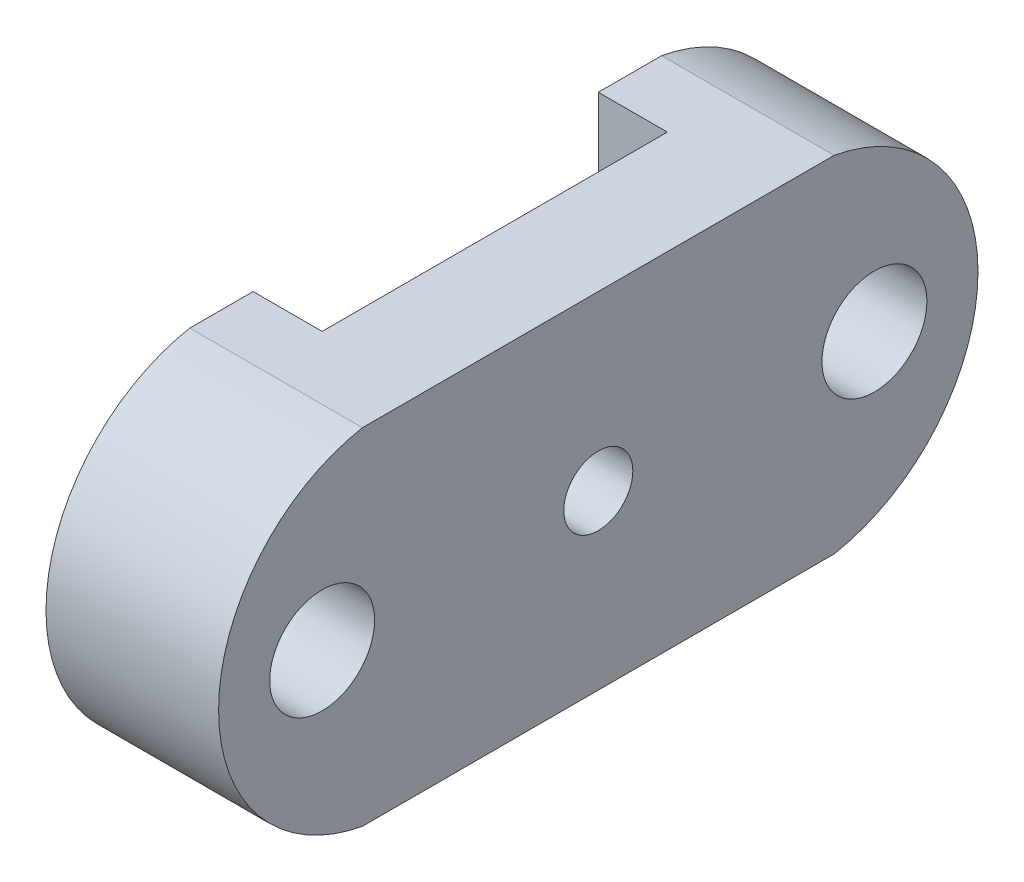
ISO-10303-21;
HEADER;
FILE_DESCRIPTION(('STEP AP214'),'2;1');
FILE_NAME('part.step','',(''),(''),'','','');
FILE_SCHEMA(('AUTOMOTIVE_DESIGN { 1 0 10303 214 1 1 1 1 }'));
ENDSEC;
DATA;
#1=APPLICATION_CONTEXT('core data for automotive mechanical design processes');
#2=APPLICATION_PROTOCOL_DEFINITION('international standard','automotive_design',2000,#1);
#3=PRODUCT_CONTEXT('',#1,'mechanical');
#4=PRODUCT('Part','Part','',(#3));
#5=PRODUCT_RELATED_PRODUCT_CATEGORY('part','',(#4));
#6=PRODUCT_DEFINITION_FORMATION('','',#4);
#7=PRODUCT_DEFINITION_CONTEXT('part definition',#1,'design');
#8=PRODUCT_DEFINITION('design','',#6,#7);
#9=PRODUCT_DEFINITION_SHAPE('','',#8);
#10=(LENGTH_UNIT() NAMED_UNIT(*) SI_UNIT(.MILLI.,.METRE.));
#11=(NAMED_UNIT(*) PLANE_ANGLE_UNIT() SI_UNIT($,.RADIAN.));
#12=(NAMED_UNIT(*) SI_UNIT($,.STERADIAN.) SOLID_ANGLE_UNIT());
#13=UNCERTAINTY_MEASURE_WITH_UNIT(LENGTH_MEASURE(1.E-05),#10,'distance_accuracy_value','');
#14=(GEOMETRIC_REPRESENTATION_CONTEXT(3) GLOBAL_UNCERTAINTY_ASSIGNED_CONTEXT((#13)) GLOBAL_UNIT_ASSIGNED_CONTEXT((#10,
#11,#12)) REPRESENTATION_CONTEXT('',''));
#15=CARTESIAN_POINT('',(0.,0.,0.));
#16=DIRECTION('',(0.,0.,1.));
#17=DIRECTION('',(1.,0.,0.));
#18=AXIS2_PLACEMENT_3D('',#15,#16,#17);
#19=CARTESIAN_POINT('',(0.,0.,0.));
#20=DIRECTION('',(-1.,0.,0.));
#21=DIRECTION('',(0.,0.,1.));
#22=AXIS2_PLACEMENT_3D('',#19,#20,#21);
#23=PLANE('',#22);
#24=CARTESIAN_POINT('',(0.,-0.00691388179685504,40.));
#25=DIRECTION('',(1.,0.,0.));
#26=DIRECTION('',(0.,0.,-1.));
#27=AXIS2_PLACEMENT_3D('',#24,#25,#26);
#28=CIRCLE('',#27,7.6);
#29=CARTESIAN_POINT('',(0.,-0.00691388179685504,32.4));
#30=VERTEX_POINT('',#29);
#31=EDGE_CURVE('E272',#30,#30,#28,.T.);
#32=ORIENTED_EDGE('',*,*,#31,.T.);
#33=EDGE_LOOP('',(#32));
#34=FACE_BOUND('',#33,.T.);
#35=DIRECTION('',(0.,0.,1.));
#36=VECTOR('',#35,1.);
#37=CARTESIAN_POINT('',(0.,-25.,-55.));
#38=LINE('',#37,#36);
#39=CARTESIAN_POINT('',(0.,-25.,25.));
#40=VERTEX_POINT('',#39);
#41=CARTESIAN_POINT('',(0.,-25.,34.1666666666667));
#42=VERTEX_POINT('',#41);
#43=EDGE_CURVE('E276',#40,#42,#38,.T.);
#44=ORIENTED_EDGE('',*,*,#43,.T.);
#45=CARTESIAN_POINT('',(0.,0.,29.5833333333333));
#46=DIRECTION('',(1.,0.,0.));
#47=DIRECTION('',(0.,0.,1.));
#48=AXIS2_PLACEMENT_3D('',#45,#46,#47);
#49=CIRCLE('',#48,25.4166666666667);
#50=CARTESIAN_POINT('',(0.,25.,34.1666666666667));
#51=VERTEX_POINT('',#50);
#52=EDGE_CURVE('E159',#51,#42,#49,.T.);
#53=ORIENTED_EDGE('',*,*,#52,.F.);
#54=DIRECTION('',(0.,0.,1.));
#55=VECTOR('',#54,1.);
#56=CARTESIAN_POINT('',(0.,25.,-55.));
#57=LINE('',#56,#55);
#58=CARTESIAN_POINT('',(0.,25.,25.));
#59=VERTEX_POINT('',#58);
#60=EDGE_CURVE('E293',#59,#51,#57,.T.);
#61=ORIENTED_EDGE('',*,*,#60,.F.);
#62=DIRECTION('',(0.,-1.,0.));
#63=VECTOR('',#62,1.);
#64=CARTESIAN_POINT('',(0.,25.,25.));
#65=LINE('',#64,#63);
#66=EDGE_CURVE('E254',#59,#40,#65,.T.);
#67=ORIENTED_EDGE('',*,*,#66,.T.);
#68=EDGE_LOOP('',(#44,#53,#61,#67));
#69=FACE_BOUND('',#68,.T.);
#70=ADVANCED_FACE('F38',(#34,#69),#23,.T.);
#71=CARTESIAN_POINT('',(25.,0.,0.));
#72=DIRECTION('',(-1.,0.,0.));
#73=DIRECTION('',(0.,0.,1.));
#74=AXIS2_PLACEMENT_3D('',#71,#72,#73);
#75=PLANE('',#74);
#76=CARTESIAN_POINT('',(25.,0.,0.));
#77=DIRECTION('',(1.,0.,0.));
#78=DIRECTION('',(0.,0.,-1.));
#79=AXIS2_PLACEMENT_3D('',#76,#77,#78);
#80=CIRCLE('',#79,5.);
#81=CARTESIAN_POINT('',(25.,0.,-5.));
#82=VERTEX_POINT('',#81);
#83=EDGE_CURVE('E258',#82,#82,#80,.T.);
#84=ORIENTED_EDGE('',*,*,#83,.F.);
#85=EDGE_LOOP('',(#84));
#86=FACE_BOUND('',#85,.T.);
#87=CARTESIAN_POINT('',(25.,-0.00691388179685504,40.));
#88=DIRECTION('',(1.,0.,0.));
#89=DIRECTION('',(0.,0.,-1.));
#90=AXIS2_PLACEMENT_3D('',#87,#88,#89);
#91=CIRCLE('',#90,7.6);
#92=CARTESIAN_POINT('',(25.,-0.00691388179685504,32.4));
#93=VERTEX_POINT('',#92);
#94=EDGE_CURVE('E277',#93,#93,#91,.T.);
#95=ORIENTED_EDGE('',*,*,#94,.F.);
#96=EDGE_LOOP('',(#95));
#97=FACE_BOUND('',#96,.T.);
#98=CARTESIAN_POINT('',(25.,-0.00691388179685504,-40.));
#99=DIRECTION('',(1.,0.,0.));
#100=DIRECTION('',(0.,0.,-1.));
#101=AXIS2_PLACEMENT_3D('',#98,#99,#100);
#102=CIRCLE('',#101,7.6);
#103=CARTESIAN_POINT('',(25.,-0.00691388179685504,-47.6));
#104=VERTEX_POINT('',#103);
#105=EDGE_CURVE('E271',#104,#104,#102,.T.);
#106=ORIENTED_EDGE('',*,*,#105,.F.);
#107=EDGE_LOOP('',(#106));
#108=FACE_BOUND('',#107,.T.);
#109=DIRECTION('',(0.,0.,1.));
#110=VECTOR('',#109,1.);
#111=CARTESIAN_POINT('',(25.,-25.,-55.));
#112=LINE('',#111,#110);
#113=CARTESIAN_POINT('',(25.,-25.,-34.1666666666666));
#114=VERTEX_POINT('',#113);
#115=CARTESIAN_POINT('',(25.,-25.,34.1666666666667));
#116=VERTEX_POINT('',#115);
#117=EDGE_CURVE('E48',#114,#116,#112,.T.);
#118=ORIENTED_EDGE('',*,*,#117,.F.);
#119=CARTESIAN_POINT('',(25.,0.,-29.5833333333333));
#120=DIRECTION('',(-1.,0.,0.));
#121=DIRECTION('',(0.,0.,1.));
#122=AXIS2_PLACEMENT_3D('',#119,#120,#121);
#123=CIRCLE('',#122,25.4166666666667);
#124=CARTESIAN_POINT('',(25.,25.,-34.1666666666667));
#125=VERTEX_POINT('',#124);
#126=EDGE_CURVE('E160',#125,#114,#123,.T.);
#127=ORIENTED_EDGE('',*,*,#126,.F.);
#128=DIRECTION('',(0.,0.,1.));
#129=VECTOR('',#128,1.);
#130=CARTESIAN_POINT('',(25.,25.,-55.));
#131=LINE('',#130,#129);
#132=CARTESIAN_POINT('',(25.,25.,34.1666666666667));
#133=VERTEX_POINT('',#132);
#134=EDGE_CURVE('E11',#125,#133,#131,.T.);
#135=ORIENTED_EDGE('',*,*,#134,.T.);
#136=CARTESIAN_POINT('',(25.,0.,29.5833333333333));
#137=DIRECTION('',(-1.,0.,0.));
#138=DIRECTION('',(0.,0.,1.));
#139=AXIS2_PLACEMENT_3D('',#136,#137,#138);
#140=CIRCLE('',#139,25.4166666666667);
#141=EDGE_CURVE('E167',#116,#133,#140,.T.);
#142=ORIENTED_EDGE('',*,*,#141,.F.);
#143=EDGE_LOOP('',(#118,#127,#135,#142));
#144=FACE_BOUND('',#143,.T.);
#145=ADVANCED_FACE('F338',(#86,#97,#108,#144),#75,.F.);
#146=CARTESIAN_POINT('',(0.,-0.00691388179685504,-40.));
#147=DIRECTION('',(1.,0.,0.));
#148=DIRECTION('',(0.,0.,-1.));
#149=AXIS2_PLACEMENT_3D('',#146,#147,#148);
#150=CIRCLE('',#149,7.6);
#151=CARTESIAN_POINT('',(0.,-0.00691388179685504,-47.6));
#152=VERTEX_POINT('',#151);
#153=EDGE_CURVE('E281',#152,#152,#150,.T.);
#154=ORIENTED_EDGE('',*,*,#153,.T.);
#155=EDGE_LOOP('',(#154));
#156=FACE_BOUND('',#155,.T.);
#157=CARTESIAN_POINT('',(0.,0.,-29.5833333333333));
#158=DIRECTION('',(1.,0.,0.));
#159=DIRECTION('',(0.,0.,-1.));
#160=AXIS2_PLACEMENT_3D('',#157,#158,#159);
#161=CIRCLE('',#160,25.4166666666667);
#162=CARTESIAN_POINT('',(0.,-25.,-34.1666666666666));
#163=VERTEX_POINT('',#162);
#164=CARTESIAN_POINT('',(0.,25.,-34.1666666666667));
#165=VERTEX_POINT('',#164);
#166=EDGE_CURVE('E164',#163,#165,#161,.T.);
#167=ORIENTED_EDGE('',*,*,#166,.F.);
#168=CARTESIAN_POINT('',(0.,-25.,-25.));
#169=VERTEX_POINT('',#168);
#170=EDGE_CURVE('E291',#163,#169,#38,.T.);
#171=ORIENTED_EDGE('',*,*,#170,.T.);
#172=DIRECTION('',(0.,-1.,0.));
#173=VECTOR('',#172,1.);
#174=CARTESIAN_POINT('',(0.,25.,-25.));
#175=LINE('',#174,#173);
#176=CARTESIAN_POINT('',(0.,25.,-25.));
#177=VERTEX_POINT('',#176);
#178=EDGE_CURVE('E243',#177,#169,#175,.T.);
#179=ORIENTED_EDGE('',*,*,#178,.F.);
#180=EDGE_CURVE('E289',#165,#177,#57,.T.);
#181=ORIENTED_EDGE('',*,*,#180,.F.);
#182=EDGE_LOOP('',(#167,#171,#179,#181));
#183=FACE_BOUND('',#182,.T.);
#184=ADVANCED_FACE('F341',(#156,#183),#23,.T.);
#185=CARTESIAN_POINT('',(25.,-25.,-55.));
#186=DIRECTION('',(0.,-1.,0.));
#187=DIRECTION('',(0.,0.,-1.));
#188=AXIS2_PLACEMENT_3D('',#185,#186,#187);
#189=PLANE('',#188);
#190=CARTESIAN_POINT('',(16.9847717652036,-25.,-19.));
#191=DIRECTION('',(0.,-1.,0.));
#192=DIRECTION('',(0.,0.,-1.));
#193=AXIS2_PLACEMENT_3D('',#190,#191,#192);
#194=CIRCLE('',#193,1.25);
#195=CARTESIAN_POINT('',(16.9847717652036,-25.,-20.25));
#196=VERTEX_POINT('',#195);
#197=EDGE_CURVE('E146',#196,#196,#194,.T.);
#198=ORIENTED_EDGE('',*,*,#197,.F.);
#199=EDGE_LOOP('',(#198));
#200=FACE_BOUND('',#199,.T.);
#201=CARTESIAN_POINT('',(16.9847717652036,-25.,19.));
#202=DIRECTION('',(0.,-1.,0.));
#203=DIRECTION('',(0.,0.,-1.));
#204=AXIS2_PLACEMENT_3D('',#201,#202,#203);
#205=CIRCLE('',#204,1.25);
#206=CARTESIAN_POINT('',(16.9847717652036,-25.,17.75));
#207=VERTEX_POINT('',#206);
#208=EDGE_CURVE('E145',#207,#207,#205,.T.);
#209=ORIENTED_EDGE('',*,*,#208,.F.);
#210=EDGE_LOOP('',(#209));
#211=FACE_BOUND('',#210,.T.);
#212=DIRECTION('',(0.,0.,1.));
#213=VECTOR('',#212,1.);
#214=CARTESIAN_POINT('',(10.,-25.,-25.));
#215=LINE('',#214,#213);
#216=CARTESIAN_POINT('',(10.,-25.,-25.));
#217=VERTEX_POINT('',#216);
#218=CARTESIAN_POINT('',(10.,-25.,25.));
#219=VERTEX_POINT('',#218);
#220=EDGE_CURVE('E248',#217,#219,#215,.T.);
#221=ORIENTED_EDGE('',*,*,#220,.F.);
#222=DIRECTION('',(1.,0.,0.));
#223=VECTOR('',#222,1.);
#224=CARTESIAN_POINT('',(0.,-25.,-25.));
#225=LINE('',#224,#223);
#226=EDGE_CURVE('E244',#169,#217,#225,.T.);
#227=ORIENTED_EDGE('',*,*,#226,.F.);
#228=ORIENTED_EDGE('',*,*,#170,.F.);
#229=DIRECTION('',(-1.,0.,0.));
#230=VECTOR('',#229,1.);
#231=CARTESIAN_POINT('',(114.30757772586,-25.,-34.1666666666666));
#232=LINE('',#231,#230);
#233=EDGE_CURVE('E176',#114,#163,#232,.T.);
#234=ORIENTED_EDGE('',*,*,#233,.F.);
#235=ORIENTED_EDGE('',*,*,#117,.T.);
#236=DIRECTION('',(-1.,0.,0.));
#237=VECTOR('',#236,1.);
#238=CARTESIAN_POINT('',(114.30757772586,-25.,34.1666666666667));
#239=LINE('',#238,#237);
#240=EDGE_CURVE('E184',#42,#116,#239,.F.);
#241=ORIENTED_EDGE('',*,*,#240,.F.);
#242=ORIENTED_EDGE('',*,*,#43,.F.);
#243=DIRECTION('',(-1.,0.,0.));
#244=VECTOR('',#243,1.);
#245=CARTESIAN_POINT('',(10.,-25.,25.));
#246=LINE('',#245,#244);
#247=EDGE_CURVE('E235',#219,#40,#246,.T.);
#248=ORIENTED_EDGE('',*,*,#247,.F.);
#249=EDGE_LOOP('',(#221,#227,#228,#234,#235,#241,#242,#248));
#250=FACE_BOUND('',#249,.T.);
#251=ADVANCED_FACE('F40',(#200,#211,#250),#189,.T.);
#252=CARTESIAN_POINT('',(25.,25.,-55.));
#253=DIRECTION('',(0.,-1.,0.));
#254=DIRECTION('',(0.,0.,-1.));
#255=AXIS2_PLACEMENT_3D('',#252,#253,#254);
#256=PLANE('',#255);
#257=DIRECTION('',(-1.,0.,0.));
#258=VECTOR('',#257,1.);
#259=CARTESIAN_POINT('',(114.30757772586,25.,34.1666666666667));
#260=LINE('',#259,#258);
#261=EDGE_CURVE('E180',#51,#133,#260,.F.);
#262=ORIENTED_EDGE('',*,*,#261,.T.);
#263=ORIENTED_EDGE('',*,*,#134,.F.);
#264=DIRECTION('',(-1.,0.,0.));
#265=VECTOR('',#264,1.);
#266=CARTESIAN_POINT('',(114.30757772586,25.,-34.1666666666667));
#267=LINE('',#266,#265);
#268=EDGE_CURVE('E163',#125,#165,#267,.T.);
#269=ORIENTED_EDGE('',*,*,#268,.T.);
#270=ORIENTED_EDGE('',*,*,#180,.T.);
#271=DIRECTION('',(1.,0.,0.));
#272=VECTOR('',#271,1.);
#273=CARTESIAN_POINT('',(0.,25.,-25.));
#274=LINE('',#273,#272);
#275=CARTESIAN_POINT('',(10.,25.,-25.));
#276=VERTEX_POINT('',#275);
#277=EDGE_CURVE('E230',#177,#276,#274,.T.);
#278=ORIENTED_EDGE('',*,*,#277,.T.);
#279=DIRECTION('',(0.,0.,1.));
#280=VECTOR('',#279,1.);
#281=CARTESIAN_POINT('',(10.,25.,-25.));
#282=LINE('',#281,#280);
#283=CARTESIAN_POINT('',(10.,25.,25.));
#284=VERTEX_POINT('',#283);
#285=EDGE_CURVE('E234',#276,#284,#282,.T.);
#286=ORIENTED_EDGE('',*,*,#285,.T.);
#287=DIRECTION('',(-1.,0.,0.));
#288=VECTOR('',#287,1.);
#289=CARTESIAN_POINT('',(10.,25.,25.));
#290=LINE('',#289,#288);
#291=EDGE_CURVE('E239',#284,#59,#290,.T.);
#292=ORIENTED_EDGE('',*,*,#291,.T.);
#293=ORIENTED_EDGE('',*,*,#60,.T.);
#294=EDGE_LOOP('',(#262,#263,#269,#270,#278,#286,#292,#293));
#295=FACE_BOUND('',#294,.T.);
#296=ADVANCED_FACE('F301',(#295),#256,.F.);
#297=CARTESIAN_POINT('',(0.,-0.00691388179685504,-40.));
#298=DIRECTION('',(1.,0.,0.));
#299=DIRECTION('',(0.,0.,-1.));
#300=AXIS2_PLACEMENT_3D('',#297,#298,#299);
#301=CYLINDRICAL_SURFACE('',#300,7.6);
#302=ORIENTED_EDGE('',*,*,#153,.F.);
#303=EDGE_LOOP('',(#302));
#304=FACE_BOUND('',#303,.T.);
#305=ORIENTED_EDGE('',*,*,#105,.T.);
#306=EDGE_LOOP('',(#305));
#307=FACE_BOUND('',#306,.T.);
#308=ADVANCED_FACE('F381',(#304,#307),#301,.F.);
#309=CARTESIAN_POINT('',(0.,-0.00691388179685504,40.));
#310=DIRECTION('',(1.,0.,0.));
#311=DIRECTION('',(0.,0.,-1.));
#312=AXIS2_PLACEMENT_3D('',#309,#310,#311);
#313=CYLINDRICAL_SURFACE('',#312,7.6);
#314=ORIENTED_EDGE('',*,*,#31,.F.);
#315=EDGE_LOOP('',(#314));
#316=FACE_BOUND('',#315,.T.);
#317=ORIENTED_EDGE('',*,*,#94,.T.);
#318=EDGE_LOOP('',(#317));
#319=FACE_BOUND('',#318,.T.);
#320=ADVANCED_FACE('F378',(#316,#319),#313,.F.);
#321=CARTESIAN_POINT('',(25.,0.,0.));
#322=DIRECTION('',(1.,0.,0.));
#323=DIRECTION('',(0.,0.,-1.));
#324=AXIS2_PLACEMENT_3D('',#321,#322,#323);
#325=CYLINDRICAL_SURFACE('',#324,5.);
#326=CARTESIAN_POINT('',(16.8,0.,0.));
#327=DIRECTION('',(1.,0.,0.));
#328=DIRECTION('',(0.,0.,-1.));
#329=AXIS2_PLACEMENT_3D('',#326,#327,#328);
#330=CIRCLE('',#329,5.);
#331=CARTESIAN_POINT('',(16.8,0.,-5.));
#332=VERTEX_POINT('',#331);
#333=EDGE_CURVE('E42',#332,#332,#330,.F.);
#334=ORIENTED_EDGE('',*,*,#333,.T.);
#335=EDGE_LOOP('',(#334));
#336=FACE_BOUND('',#335,.T.);
#337=ORIENTED_EDGE('',*,*,#83,.T.);
#338=EDGE_LOOP('',(#337));
#339=FACE_BOUND('',#338,.T.);
#340=ADVANCED_FACE('F317',(#336,#339),#325,.F.);
#341=CARTESIAN_POINT('',(10.,25.,-25.));
#342=DIRECTION('',(1.,0.,0.));
#343=DIRECTION('',(0.,0.,-1.));
#344=AXIS2_PLACEMENT_3D('',#341,#342,#343);
#345=PLANE('',#344);
#346=DIRECTION('',(0.,0.,1.));
#347=VECTOR('',#346,1.);
#348=CARTESIAN_POINT('',(10.,-7.5,6.5));
#349=LINE('',#348,#347);
#350=CARTESIAN_POINT('',(10.,-7.5,-6.5));
#351=VERTEX_POINT('',#350);
#352=CARTESIAN_POINT('',(10.,-7.5,6.5));
#353=VERTEX_POINT('',#352);
#354=EDGE_CURVE('E208',#351,#353,#349,.T.);
#355=ORIENTED_EDGE('',*,*,#354,.F.);
#356=DIRECTION('',(0.,-1.,0.));
#357=VECTOR('',#356,1.);
#358=CARTESIAN_POINT('',(10.,7.5,-6.5));
#359=LINE('',#358,#357);
#360=CARTESIAN_POINT('',(10.,7.5,-6.5));
#361=VERTEX_POINT('',#360);
#362=EDGE_CURVE('E63',#361,#351,#359,.T.);
#363=ORIENTED_EDGE('',*,*,#362,.F.);
#364=DIRECTION('',(0.,0.,-1.));
#365=VECTOR('',#364,1.);
#366=CARTESIAN_POINT('',(10.,7.5,6.5));
#367=LINE('',#366,#365);
#368=CARTESIAN_POINT('',(10.,7.5,6.5));
#369=VERTEX_POINT('',#368);
#370=EDGE_CURVE('E193',#369,#361,#367,.T.);
#371=ORIENTED_EDGE('',*,*,#370,.F.);
#372=DIRECTION('',(0.,1.,0.));
#373=VECTOR('',#372,1.);
#374=CARTESIAN_POINT('',(10.,7.5,6.5));
#375=LINE('',#374,#373);
#376=EDGE_CURVE('E212',#353,#369,#375,.T.);
#377=ORIENTED_EDGE('',*,*,#376,.F.);
#378=EDGE_LOOP('',(#355,#363,#371,#377));
#379=FACE_BOUND('',#378,.T.);
#380=ORIENTED_EDGE('',*,*,#220,.T.);
#381=DIRECTION('',(0.,-1.,0.));
#382=VECTOR('',#381,1.);
#383=CARTESIAN_POINT('',(10.,25.,25.));
#384=LINE('',#383,#382);
#385=EDGE_CURVE('E259',#284,#219,#384,.T.);
#386=ORIENTED_EDGE('',*,*,#385,.F.);
#387=ORIENTED_EDGE('',*,*,#285,.F.);
#388=DIRECTION('',(0.,-1.,0.));
#389=VECTOR('',#388,1.);
#390=CARTESIAN_POINT('',(10.,25.,-25.));
#391=LINE('',#390,#389);
#392=EDGE_CURVE('E262',#276,#217,#391,.T.);
#393=ORIENTED_EDGE('',*,*,#392,.T.);
#394=EDGE_LOOP('',(#380,#386,#387,#393));
#395=FACE_BOUND('',#394,.T.);
#396=ADVANCED_FACE('F365',(#379,#395),#345,.F.);
#397=CARTESIAN_POINT('',(10.,25.,25.));
#398=DIRECTION('',(0.,0.,1.));
#399=DIRECTION('',(1.,0.,0.));
#400=AXIS2_PLACEMENT_3D('',#397,#398,#399);
#401=PLANE('',#400);
#402=ORIENTED_EDGE('',*,*,#247,.T.);
#403=ORIENTED_EDGE('',*,*,#66,.F.);
#404=ORIENTED_EDGE('',*,*,#291,.F.);
#405=ORIENTED_EDGE('',*,*,#385,.T.);
#406=EDGE_LOOP('',(#402,#403,#404,#405));
#407=FACE_BOUND('',#406,.T.);
#408=ADVANCED_FACE('F332',(#407),#401,.F.);
#409=CARTESIAN_POINT('',(0.,25.,-25.));
#410=DIRECTION('',(0.,0.,-1.));
#411=DIRECTION('',(0.,1.,0.));
#412=AXIS2_PLACEMENT_3D('',#409,#410,#411);
#413=PLANE('',#412);
#414=ORIENTED_EDGE('',*,*,#226,.T.);
#415=ORIENTED_EDGE('',*,*,#392,.F.);
#416=ORIENTED_EDGE('',*,*,#277,.F.);
#417=ORIENTED_EDGE('',*,*,#178,.T.);
#418=EDGE_LOOP('',(#414,#415,#416,#417));
#419=FACE_BOUND('',#418,.T.);
#420=ADVANCED_FACE('F323',(#419),#413,.F.);
#421=CARTESIAN_POINT('',(16.8,0.,0.));
#422=DIRECTION('',(1.,0.,0.));
#423=DIRECTION('',(0.,0.,-1.));
#424=AXIS2_PLACEMENT_3D('',#421,#422,#423);
#425=PLANE('',#424);
#426=DIRECTION('',(0.,-1.,0.));
#427=VECTOR('',#426,1.);
#428=CARTESIAN_POINT('',(16.8,7.5,-6.5));
#429=LINE('',#428,#427);
#430=CARTESIAN_POINT('',(16.8,7.5,-6.5));
#431=VERTEX_POINT('',#430);
#432=CARTESIAN_POINT('',(16.8,-7.5,-6.5));
#433=VERTEX_POINT('',#432);
#434=EDGE_CURVE('E188',#431,#433,#429,.T.);
#435=ORIENTED_EDGE('',*,*,#434,.T.);
#436=DIRECTION('',(0.,0.,1.));
#437=VECTOR('',#436,1.);
#438=CARTESIAN_POINT('',(16.8,-7.5,6.5));
#439=LINE('',#438,#437);
#440=CARTESIAN_POINT('',(16.8,-7.5,6.5));
#441=VERTEX_POINT('',#440);
#442=EDGE_CURVE('E192',#433,#441,#439,.T.);
#443=ORIENTED_EDGE('',*,*,#442,.T.);
#444=DIRECTION('',(0.,1.,0.));
#445=VECTOR('',#444,1.);
#446=CARTESIAN_POINT('',(16.8,7.5,6.5));
#447=LINE('',#446,#445);
#448=CARTESIAN_POINT('',(16.8,7.5,6.5));
#449=VERTEX_POINT('',#448);
#450=EDGE_CURVE('E197',#441,#449,#447,.T.);
#451=ORIENTED_EDGE('',*,*,#450,.T.);
#452=DIRECTION('',(0.,0.,-1.));
#453=VECTOR('',#452,1.);
#454=CARTESIAN_POINT('',(16.8,7.5,6.5));
#455=LINE('',#454,#453);
#456=EDGE_CURVE('E201',#449,#431,#455,.T.);
#457=ORIENTED_EDGE('',*,*,#456,.T.);
#458=EDGE_LOOP('',(#435,#443,#451,#457));
#459=FACE_BOUND('',#458,.T.);
#460=ORIENTED_EDGE('',*,*,#333,.F.);
#461=EDGE_LOOP('',(#460));
#462=FACE_BOUND('',#461,.T.);
#463=ADVANCED_FACE('F320',(#459,#462),#425,.F.);
#464=CARTESIAN_POINT('',(16.8,7.5,-6.5));
#465=DIRECTION('',(0.,0.,-1.));
#466=DIRECTION('',(0.,1.,0.));
#467=AXIS2_PLACEMENT_3D('',#464,#465,#466);
#468=PLANE('',#467);
#469=ORIENTED_EDGE('',*,*,#362,.T.);
#470=DIRECTION('',(-1.,0.,0.));
#471=VECTOR('',#470,1.);
#472=CARTESIAN_POINT('',(16.8,-7.5,-6.5));
#473=LINE('',#472,#471);
#474=EDGE_CURVE('E205',#433,#351,#473,.T.);
#475=ORIENTED_EDGE('',*,*,#474,.F.);
#476=ORIENTED_EDGE('',*,*,#434,.F.);
#477=DIRECTION('',(-1.,0.,0.));
#478=VECTOR('',#477,1.);
#479=CARTESIAN_POINT('',(16.8,7.5,-6.5));
#480=LINE('',#479,#478);
#481=EDGE_CURVE('E219',#431,#361,#480,.T.);
#482=ORIENTED_EDGE('',*,*,#481,.T.);
#483=EDGE_LOOP('',(#469,#475,#476,#482));
#484=FACE_BOUND('',#483,.T.);
#485=ADVANCED_FACE('F322',(#484),#468,.F.);
#486=CARTESIAN_POINT('',(16.8,7.5,6.5));
#487=DIRECTION('',(0.,1.,0.));
#488=DIRECTION('',(0.,0.,1.));
#489=AXIS2_PLACEMENT_3D('',#486,#487,#488);
#490=PLANE('',#489);
#491=ORIENTED_EDGE('',*,*,#370,.T.);
#492=ORIENTED_EDGE('',*,*,#481,.F.);
#493=ORIENTED_EDGE('',*,*,#456,.F.);
#494=DIRECTION('',(-1.,0.,0.));
#495=VECTOR('',#494,1.);
#496=CARTESIAN_POINT('',(16.8,7.5,6.5));
#497=LINE('',#496,#495);
#498=EDGE_CURVE('E222',#449,#369,#497,.T.);
#499=ORIENTED_EDGE('',*,*,#498,.T.);
#500=EDGE_LOOP('',(#491,#492,#493,#499));
#501=FACE_BOUND('',#500,.T.);
#502=ADVANCED_FACE('F330',(#501),#490,.F.);
#503=CARTESIAN_POINT('',(16.8,7.5,6.5));
#504=DIRECTION('',(0.,0.,1.));
#505=DIRECTION('',(0.,-1.,0.));
#506=AXIS2_PLACEMENT_3D('',#503,#504,#505);
#507=PLANE('',#506);
#508=ORIENTED_EDGE('',*,*,#376,.T.);
#509=ORIENTED_EDGE('',*,*,#498,.F.);
#510=ORIENTED_EDGE('',*,*,#450,.F.);
#511=DIRECTION('',(-1.,0.,0.));
#512=VECTOR('',#511,1.);
#513=CARTESIAN_POINT('',(16.8,-7.5,6.5));
#514=LINE('',#513,#512);
#515=EDGE_CURVE('E225',#441,#353,#514,.T.);
#516=ORIENTED_EDGE('',*,*,#515,.T.);
#517=EDGE_LOOP('',(#508,#509,#510,#516));
#518=FACE_BOUND('',#517,.T.);
#519=ADVANCED_FACE('F504',(#518),#507,.F.);
#520=CARTESIAN_POINT('',(16.8,-7.5,6.5));
#521=DIRECTION('',(0.,-1.,0.));
#522=DIRECTION('',(0.,0.,-1.));
#523=AXIS2_PLACEMENT_3D('',#520,#521,#522);
#524=PLANE('',#523);
#525=ORIENTED_EDGE('',*,*,#354,.T.);
#526=ORIENTED_EDGE('',*,*,#515,.F.);
#527=ORIENTED_EDGE('',*,*,#442,.F.);
#528=ORIENTED_EDGE('',*,*,#474,.T.);
#529=EDGE_LOOP('',(#525,#526,#527,#528));
#530=FACE_BOUND('',#529,.T.);
#531=ADVANCED_FACE('F402',(#530),#524,.F.);
#532=CARTESIAN_POINT('',(114.30757772586,0.,-29.5833333333333));
#533=DIRECTION('',(-1.,0.,0.));
#534=DIRECTION('',(0.,0.,1.));
#535=AXIS2_PLACEMENT_3D('',#532,#533,#534);
#536=CYLINDRICAL_SURFACE('',#535,25.4166666666667);
#537=ORIENTED_EDGE('',*,*,#166,.T.);
#538=ORIENTED_EDGE('',*,*,#268,.F.);
#539=ORIENTED_EDGE('',*,*,#126,.T.);
#540=ORIENTED_EDGE('',*,*,#233,.T.);
#541=EDGE_LOOP('',(#537,#538,#539,#540));
#542=FACE_BOUND('',#541,.T.);
#543=ADVANCED_FACE('F360',(#542),#536,.T.);
#544=CARTESIAN_POINT('',(114.30757772586,0.,29.5833333333333));
#545=DIRECTION('',(-1.,0.,0.));
#546=DIRECTION('',(0.,0.,1.));
#547=AXIS2_PLACEMENT_3D('',#544,#545,#546);
#548=CYLINDRICAL_SURFACE('',#547,25.4166666666667);
#549=ORIENTED_EDGE('',*,*,#52,.T.);
#550=ORIENTED_EDGE('',*,*,#240,.T.);
#551=ORIENTED_EDGE('',*,*,#141,.T.);
#552=ORIENTED_EDGE('',*,*,#261,.F.);
#553=EDGE_LOOP('',(#549,#550,#551,#552));
#554=FACE_BOUND('',#553,.T.);
#555=ADVANCED_FACE('F309',(#554),#548,.T.);
#556=CARTESIAN_POINT('',(16.9847717652036,7.49999999999999,19.));
#557=DIRECTION('',(0.,-1.,0.));
#558=DIRECTION('',(0.,0.,-1.));
#559=AXIS2_PLACEMENT_3D('',#556,#557,#558);
#560=CONICAL_SURFACE('',#559,1.24999999999999,1.02974425867665);
#561=CARTESIAN_POINT('',(16.9847717652036,8.25107577378444,19.));
#562=VERTEX_POINT('',#561);
#563=VERTEX_LOOP('',#562);
#564=FACE_BOUND('',#563,.T.);
#565=CARTESIAN_POINT('',(16.9847717652036,7.49999999999999,19.));
#566=DIRECTION('',(0.,-1.,0.));
#567=DIRECTION('',(0.,0.,-1.));
#568=AXIS2_PLACEMENT_3D('',#565,#566,#567);
#569=CIRCLE('',#568,1.24999999999999);
#570=CARTESIAN_POINT('',(16.9847717652036,7.49999999999999,17.75));
#571=VERTEX_POINT('',#570);
#572=EDGE_CURVE('E151',#571,#571,#569,.T.);
#573=ORIENTED_EDGE('',*,*,#572,.T.);
#574=EDGE_LOOP('',(#573));
#575=FACE_BOUND('',#574,.T.);
#576=ADVANCED_FACE('F411',(#564,#575),#560,.F.);
#577=CARTESIAN_POINT('',(16.9847717652036,-25.,19.));
#578=DIRECTION('',(0.,-1.,0.));
#579=DIRECTION('',(0.,0.,-1.));
#580=AXIS2_PLACEMENT_3D('',#577,#578,#579);
#581=CYLINDRICAL_SURFACE('',#580,1.24999999999999);
#582=ORIENTED_EDGE('',*,*,#572,.F.);
#583=EDGE_LOOP('',(#582));
#584=FACE_BOUND('',#583,.T.);
#585=ORIENTED_EDGE('',*,*,#208,.T.);
#586=EDGE_LOOP('',(#585));
#587=FACE_BOUND('',#586,.T.);
#588=ADVANCED_FACE('F138',(#584,#587),#581,.F.);
#589=CARTESIAN_POINT('',(16.9847717652036,7.5,-19.));
#590=DIRECTION('',(0.,-1.,0.));
#591=DIRECTION('',(0.,0.,-1.));
#592=AXIS2_PLACEMENT_3D('',#589,#590,#591);
#593=CONICAL_SURFACE('',#592,1.24999999999999,1.02974425867665);
#594=CARTESIAN_POINT('',(16.9847717652036,8.25107577378445,-19.));
#595=VERTEX_POINT('',#594);
#596=VERTEX_LOOP('',#595);
#597=FACE_BOUND('',#596,.T.);
#598=CARTESIAN_POINT('',(16.9847717652036,7.5,-19.));
#599=DIRECTION('',(0.,-1.,0.));
#600=DIRECTION('',(0.,0.,-1.));
#601=AXIS2_PLACEMENT_3D('',#598,#599,#600);
#602=CIRCLE('',#601,1.24999999999999);
#603=CARTESIAN_POINT('',(16.9847717652036,7.5,-20.25));
#604=VERTEX_POINT('',#603);
#605=EDGE_CURVE('E142',#604,#604,#602,.T.);
#606=ORIENTED_EDGE('',*,*,#605,.T.);
#607=EDGE_LOOP('',(#606));
#608=FACE_BOUND('',#607,.T.);
#609=ADVANCED_FACE('F134',(#597,#608),#593,.F.);
#610=CARTESIAN_POINT('',(16.9847717652036,-25.,-19.));
#611=DIRECTION('',(0.,-1.,0.));
#612=DIRECTION('',(0.,0.,-1.));
#613=AXIS2_PLACEMENT_3D('',#610,#611,#612);
#614=CYLINDRICAL_SURFACE('',#613,1.24999999999999);
#615=ORIENTED_EDGE('',*,*,#605,.F.);
#616=EDGE_LOOP('',(#615));
#617=FACE_BOUND('',#616,.T.);
#618=ORIENTED_EDGE('',*,*,#197,.T.);
#619=EDGE_LOOP('',(#618));
#620=FACE_BOUND('',#619,.T.);
#621=ADVANCED_FACE('F137',(#617,#620),#614,.F.);
#622=CLOSED_SHELL('',(#70,#145,#184,#251,#296,#308,#320,#340,#396,#408,#420,#463,#485,#502,#519,
#531,#543,#555,#576,#588,#609,#621));
#623=MANIFOLD_SOLID_BREP('B2',#622);
#624=ADVANCED_BREP_SHAPE_REPRESENTATION('',(#18,#623),#14);
#625=SHAPE_DEFINITION_REPRESENTATION(#9,#624);
ENDSEC;
END-ISO-10303-21;
